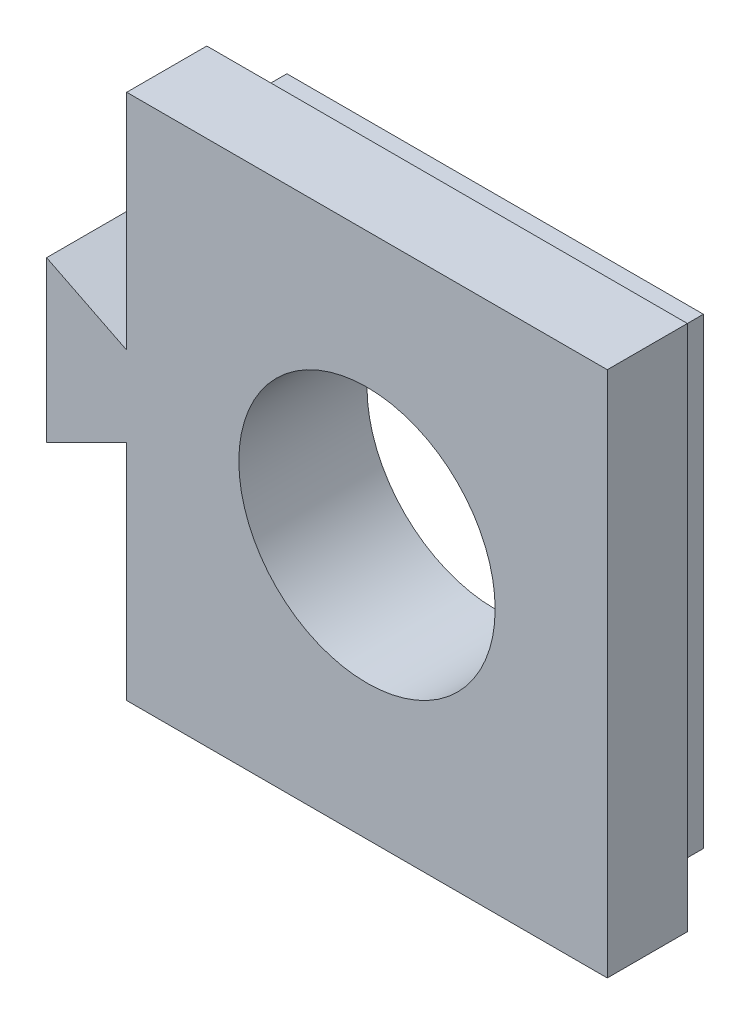
ISO-10303-21;
HEADER;
FILE_DESCRIPTION(('STEP AP214'),'2;1');
FILE_NAME('part.step','',(''),(''),'','','');
FILE_SCHEMA(('AUTOMOTIVE_DESIGN { 1 0 10303 214 1 1 1 1 }'));
ENDSEC;
DATA;
#1=APPLICATION_CONTEXT('core data for automotive mechanical design processes');
#2=APPLICATION_PROTOCOL_DEFINITION('international standard','automotive_design',2000,#1);
#3=PRODUCT_CONTEXT('',#1,'mechanical');
#4=PRODUCT('Part','Part','',(#3));
#5=PRODUCT_RELATED_PRODUCT_CATEGORY('part','',(#4));
#6=PRODUCT_DEFINITION_FORMATION('','',#4);
#7=PRODUCT_DEFINITION_CONTEXT('part definition',#1,'design');
#8=PRODUCT_DEFINITION('design','',#6,#7);
#9=PRODUCT_DEFINITION_SHAPE('','',#8);
#10=(LENGTH_UNIT() NAMED_UNIT(*) SI_UNIT(.MILLI.,.METRE.));
#11=(NAMED_UNIT(*) PLANE_ANGLE_UNIT() SI_UNIT($,.RADIAN.));
#12=(NAMED_UNIT(*) SI_UNIT($,.STERADIAN.) SOLID_ANGLE_UNIT());
#13=UNCERTAINTY_MEASURE_WITH_UNIT(LENGTH_MEASURE(1.E-05),#10,'distance_accuracy_value','');
#14=(GEOMETRIC_REPRESENTATION_CONTEXT(3) GLOBAL_UNCERTAINTY_ASSIGNED_CONTEXT((#13)) GLOBAL_UNIT_ASSIGNED_CONTEXT((#10,
#11,#12)) REPRESENTATION_CONTEXT('',''));
#15=CARTESIAN_POINT('',(0.,0.,0.));
#16=DIRECTION('',(0.,0.,1.));
#17=DIRECTION('',(1.,0.,0.));
#18=AXIS2_PLACEMENT_3D('',#15,#16,#17);
#19=CARTESIAN_POINT('',(-4.,25.6,8.));
#20=DIRECTION('',(1.,0.,0.));
#21=DIRECTION('',(0.,0.,-1.));
#22=AXIS2_PLACEMENT_3D('',#19,#20,#21);
#23=PLANE('',#22);
#24=DIRECTION('',(0.,0.,1.));
#25=VECTOR('',#24,1.);
#26=CARTESIAN_POINT('',(-4.,6.65760929328095,3.));
#27=LINE('',#26,#25);
#28=CARTESIAN_POINT('',(-4.,6.65760929328095,3.));
#29=VERTEX_POINT('',#28);
#30=CARTESIAN_POINT('',(-4.,6.65760929328095,8.));
#31=VERTEX_POINT('',#30);
#32=EDGE_CURVE('E173',#29,#31,#27,.T.);
#33=ORIENTED_EDGE('',*,*,#32,.F.);
#34=DIRECTION('',(0.,-1.,0.));
#35=VECTOR('',#34,1.);
#36=CARTESIAN_POINT('',(-4.,25.6,3.));
#37=LINE('',#36,#35);
#38=CARTESIAN_POINT('',(-4.,-7.28478141343808,3.));
#39=VERTEX_POINT('',#38);
#40=EDGE_CURVE('E193',#29,#39,#37,.T.);
#41=ORIENTED_EDGE('',*,*,#40,.T.);
#42=DIRECTION('',(0.,0.,-1.));
#43=VECTOR('',#42,1.);
#44=CARTESIAN_POINT('',(-4.,-7.28478141343808,8.));
#45=LINE('',#44,#43);
#46=CARTESIAN_POINT('',(-4.,-7.28478141343808,8.));
#47=VERTEX_POINT('',#46);
#48=EDGE_CURVE('E199',#47,#39,#45,.T.);
#49=ORIENTED_EDGE('',*,*,#48,.F.);
#50=DIRECTION('',(0.,-1.,0.));
#51=VECTOR('',#50,1.);
#52=CARTESIAN_POINT('',(-4.,25.6,8.));
#53=LINE('',#52,#51);
#54=EDGE_CURVE('E182',#31,#47,#53,.T.);
#55=ORIENTED_EDGE('',*,*,#54,.F.);
#56=EDGE_LOOP('',(#33,#41,#49,#55));
#57=FACE_BOUND('',#56,.T.);
#58=ADVANCED_FACE('F41',(#57),#23,.F.);
#59=CARTESIAN_POINT('',(0.,0.,0.));
#60=DIRECTION('',(0.,0.,-1.));
#61=DIRECTION('',(-1.,0.,0.));
#62=AXIS2_PLACEMENT_3D('',#59,#60,#61);
#63=PLANE('',#62);
#64=DIRECTION('',(0.,-1.,0.));
#65=VECTOR('',#64,1.);
#66=CARTESIAN_POINT('',(-2.,-5.28478141343808,0.));
#67=LINE('',#66,#65);
#68=CARTESIAN_POINT('',(-2.,23.6,0.));
#69=VERTEX_POINT('',#68);
#70=CARTESIAN_POINT('',(-2.,-5.28478141343808,0.));
#71=VERTEX_POINT('',#70);
#72=EDGE_CURVE('E211',#69,#71,#67,.T.);
#73=ORIENTED_EDGE('',*,*,#72,.F.);
#74=DIRECTION('',(-1.,0.,0.));
#75=VECTOR('',#74,1.);
#76=CARTESIAN_POINT('',(-2.,23.6,0.));
#77=LINE('',#76,#75);
#78=CARTESIAN_POINT('',(24.,23.6,0.));
#79=VERTEX_POINT('',#78);
#80=EDGE_CURVE('E86',#79,#69,#77,.T.);
#81=ORIENTED_EDGE('',*,*,#80,.F.);
#82=DIRECTION('',(0.,1.,0.));
#83=VECTOR('',#82,1.);
#84=CARTESIAN_POINT('',(24.,-5.28478141343808,0.));
#85=LINE('',#84,#83);
#86=CARTESIAN_POINT('',(24.,-5.28478141343808,0.));
#87=VERTEX_POINT('',#86);
#88=EDGE_CURVE('E227',#87,#79,#85,.T.);
#89=ORIENTED_EDGE('',*,*,#88,.F.);
#90=DIRECTION('',(1.,0.,0.));
#91=VECTOR('',#90,1.);
#92=CARTESIAN_POINT('',(-2.,-5.28478141343808,0.));
#93=LINE('',#92,#91);
#94=EDGE_CURVE('E225',#71,#87,#93,.T.);
#95=ORIENTED_EDGE('',*,*,#94,.F.);
#96=EDGE_LOOP('',(#73,#81,#89,#95));
#97=FACE_BOUND('',#96,.T.);
#98=CARTESIAN_POINT('',(11.,9.15760929328096,0.));
#99=DIRECTION('',(0.,0.,1.));
#100=DIRECTION('',(1.,0.,0.));
#101=AXIS2_PLACEMENT_3D('',#98,#99,#100);
#102=CIRCLE('',#101,8.);
#103=CARTESIAN_POINT('',(19.,9.15760929328096,0.));
#104=VERTEX_POINT('',#103);
#105=EDGE_CURVE('E208',#104,#104,#102,.T.);
#106=ORIENTED_EDGE('',*,*,#105,.T.);
#107=EDGE_LOOP('',(#106));
#108=FACE_BOUND('',#107,.T.);
#109=ADVANCED_FACE('F237',(#97,#108),#63,.T.);
#110=CARTESIAN_POINT('',(-2.,-5.28478141343808,3.));
#111=DIRECTION('',(1.,0.,0.));
#112=DIRECTION('',(0.,1.,0.));
#113=AXIS2_PLACEMENT_3D('',#110,#111,#112);
#114=PLANE('',#113);
#115=ORIENTED_EDGE('',*,*,#72,.T.);
#116=DIRECTION('',(0.,0.,-1.));
#117=VECTOR('',#116,1.);
#118=CARTESIAN_POINT('',(-2.,-5.28478141343808,3.));
#119=LINE('',#118,#117);
#120=CARTESIAN_POINT('',(-2.,-5.28478141343808,3.));
#121=VERTEX_POINT('',#120);
#122=EDGE_CURVE('E11',#121,#71,#119,.T.);
#123=ORIENTED_EDGE('',*,*,#122,.F.);
#124=DIRECTION('',(0.,-1.,0.));
#125=VECTOR('',#124,1.);
#126=CARTESIAN_POINT('',(-2.,-5.28478141343808,3.));
#127=LINE('',#126,#125);
#128=CARTESIAN_POINT('',(-2.,23.6,3.));
#129=VERTEX_POINT('',#128);
#130=EDGE_CURVE('E212',#129,#121,#127,.T.);
#131=ORIENTED_EDGE('',*,*,#130,.F.);
#132=DIRECTION('',(0.,0.,-1.));
#133=VECTOR('',#132,1.);
#134=CARTESIAN_POINT('',(-2.,23.6,3.));
#135=LINE('',#134,#133);
#136=EDGE_CURVE('E222',#129,#69,#135,.T.);
#137=ORIENTED_EDGE('',*,*,#136,.T.);
#138=EDGE_LOOP('',(#115,#123,#131,#137));
#139=FACE_BOUND('',#138,.T.);
#140=ADVANCED_FACE('F43',(#139),#114,.F.);
#141=CARTESIAN_POINT('',(-2.,-5.28478141343808,3.));
#142=DIRECTION('',(0.,1.,0.));
#143=DIRECTION('',(-1.,0.,0.));
#144=AXIS2_PLACEMENT_3D('',#141,#142,#143);
#145=PLANE('',#144);
#146=ORIENTED_EDGE('',*,*,#94,.T.);
#147=DIRECTION('',(0.,0.,-1.));
#148=VECTOR('',#147,1.);
#149=CARTESIAN_POINT('',(24.,-5.28478141343808,3.));
#150=LINE('',#149,#148);
#151=CARTESIAN_POINT('',(24.,-5.28478141343808,3.));
#152=VERTEX_POINT('',#151);
#153=EDGE_CURVE('E50',#152,#87,#150,.T.);
#154=ORIENTED_EDGE('',*,*,#153,.F.);
#155=DIRECTION('',(1.,0.,0.));
#156=VECTOR('',#155,1.);
#157=CARTESIAN_POINT('',(-2.,-5.28478141343808,3.));
#158=LINE('',#157,#156);
#159=EDGE_CURVE('E91',#121,#152,#158,.T.);
#160=ORIENTED_EDGE('',*,*,#159,.F.);
#161=ORIENTED_EDGE('',*,*,#122,.T.);
#162=EDGE_LOOP('',(#146,#154,#160,#161));
#163=FACE_BOUND('',#162,.T.);
#164=ADVANCED_FACE('F376',(#163),#145,.F.);
#165=CARTESIAN_POINT('',(24.,-5.28478141343808,3.));
#166=DIRECTION('',(-1.,0.,0.));
#167=DIRECTION('',(0.,-1.,0.));
#168=AXIS2_PLACEMENT_3D('',#165,#166,#167);
#169=PLANE('',#168);
#170=ORIENTED_EDGE('',*,*,#88,.T.);
#171=DIRECTION('',(0.,0.,-1.));
#172=VECTOR('',#171,1.);
#173=CARTESIAN_POINT('',(24.,23.6,3.));
#174=LINE('',#173,#172);
#175=CARTESIAN_POINT('',(24.,23.6,3.));
#176=VERTEX_POINT('',#175);
#177=EDGE_CURVE('E66',#176,#79,#174,.T.);
#178=ORIENTED_EDGE('',*,*,#177,.F.);
#179=DIRECTION('',(0.,1.,0.));
#180=VECTOR('',#179,1.);
#181=CARTESIAN_POINT('',(24.,-5.28478141343808,3.));
#182=LINE('',#181,#180);
#183=EDGE_CURVE('E216',#152,#176,#182,.T.);
#184=ORIENTED_EDGE('',*,*,#183,.F.);
#185=ORIENTED_EDGE('',*,*,#153,.T.);
#186=EDGE_LOOP('',(#170,#178,#184,#185));
#187=FACE_BOUND('',#186,.T.);
#188=ADVANCED_FACE('F234',(#187),#169,.F.);
#189=CARTESIAN_POINT('',(-2.,23.6,3.));
#190=DIRECTION('',(0.,-1.,0.));
#191=DIRECTION('',(1.,0.,0.));
#192=AXIS2_PLACEMENT_3D('',#189,#190,#191);
#193=PLANE('',#192);
#194=ORIENTED_EDGE('',*,*,#80,.T.);
#195=ORIENTED_EDGE('',*,*,#136,.F.);
#196=DIRECTION('',(-1.,0.,0.));
#197=VECTOR('',#196,1.);
#198=CARTESIAN_POINT('',(-2.,23.6,3.));
#199=LINE('',#198,#197);
#200=EDGE_CURVE('E219',#176,#129,#199,.T.);
#201=ORIENTED_EDGE('',*,*,#200,.F.);
#202=ORIENTED_EDGE('',*,*,#177,.T.);
#203=EDGE_LOOP('',(#194,#195,#201,#202));
#204=FACE_BOUND('',#203,.T.);
#205=ADVANCED_FACE('F240',(#204),#193,.F.);
#206=CARTESIAN_POINT('',(11.,9.15760929328096,3.));
#207=DIRECTION('',(0.,0.,-1.));
#208=DIRECTION('',(-1.,0.,0.));
#209=AXIS2_PLACEMENT_3D('',#206,#207,#208);
#210=CYLINDRICAL_SURFACE('',#209,8.);
#211=ORIENTED_EDGE('',*,*,#105,.F.);
#212=EDGE_LOOP('',(#211));
#213=FACE_BOUND('',#212,.T.);
#214=CARTESIAN_POINT('',(11.,9.15760929328096,8.));
#215=DIRECTION('',(0.,0.,1.));
#216=DIRECTION('',(1.,0.,0.));
#217=AXIS2_PLACEMENT_3D('',#214,#215,#216);
#218=CIRCLE('',#217,8.);
#219=CARTESIAN_POINT('',(19.,9.15760929328096,8.));
#220=VERTEX_POINT('',#219);
#221=EDGE_CURVE('E45',#220,#220,#218,.T.);
#222=ORIENTED_EDGE('',*,*,#221,.T.);
#223=EDGE_LOOP('',(#222));
#224=FACE_BOUND('',#223,.T.);
#225=ADVANCED_FACE('F301',(#213,#224),#210,.F.);
#226=CARTESIAN_POINT('',(26.,-7.28478141343808,8.));
#227=DIRECTION('',(-1.,0.,0.));
#228=DIRECTION('',(0.,-1.,0.));
#229=AXIS2_PLACEMENT_3D('',#226,#227,#228);
#230=PLANE('',#229);
#231=DIRECTION('',(0.,1.,0.));
#232=VECTOR('',#231,1.);
#233=CARTESIAN_POINT('',(26.,-7.28478141343808,3.));
#234=LINE('',#233,#232);
#235=CARTESIAN_POINT('',(26.,-7.28478141343808,3.));
#236=VERTEX_POINT('',#235);
#237=CARTESIAN_POINT('',(26.,25.6,3.));
#238=VERTEX_POINT('',#237);
#239=EDGE_CURVE('E172',#236,#238,#234,.T.);
#240=ORIENTED_EDGE('',*,*,#239,.T.);
#241=DIRECTION('',(0.,0.,-1.));
#242=VECTOR('',#241,1.);
#243=CARTESIAN_POINT('',(26.,25.6,8.));
#244=LINE('',#243,#242);
#245=CARTESIAN_POINT('',(26.,25.6,8.));
#246=VERTEX_POINT('',#245);
#247=EDGE_CURVE('E205',#246,#238,#244,.T.);
#248=ORIENTED_EDGE('',*,*,#247,.F.);
#249=DIRECTION('',(0.,1.,0.));
#250=VECTOR('',#249,1.);
#251=CARTESIAN_POINT('',(26.,-7.28478141343808,8.));
#252=LINE('',#251,#250);
#253=CARTESIAN_POINT('',(26.,-7.28478141343808,8.));
#254=VERTEX_POINT('',#253);
#255=EDGE_CURVE('E176',#254,#246,#252,.T.);
#256=ORIENTED_EDGE('',*,*,#255,.F.);
#257=DIRECTION('',(0.,0.,-1.));
#258=VECTOR('',#257,1.);
#259=CARTESIAN_POINT('',(26.,-7.28478141343808,8.));
#260=LINE('',#259,#258);
#261=EDGE_CURVE('E188',#254,#236,#260,.T.);
#262=ORIENTED_EDGE('',*,*,#261,.T.);
#263=EDGE_LOOP('',(#240,#248,#256,#262));
#264=FACE_BOUND('',#263,.T.);
#265=ADVANCED_FACE('F273',(#264),#230,.F.);
#266=CARTESIAN_POINT('',(26.,25.6,8.));
#267=DIRECTION('',(0.,-1.,0.));
#268=DIRECTION('',(1.,0.,0.));
#269=AXIS2_PLACEMENT_3D('',#266,#267,#268);
#270=PLANE('',#269);
#271=DIRECTION('',(-1.,0.,0.));
#272=VECTOR('',#271,1.);
#273=CARTESIAN_POINT('',(26.,25.6,3.));
#274=LINE('',#273,#272);
#275=CARTESIAN_POINT('',(-4.,25.6,3.));
#276=VERTEX_POINT('',#275);
#277=EDGE_CURVE('E191',#238,#276,#274,.T.);
#278=ORIENTED_EDGE('',*,*,#277,.T.);
#279=DIRECTION('',(0.,0.,-1.));
#280=VECTOR('',#279,1.);
#281=CARTESIAN_POINT('',(-4.,25.6,8.));
#282=LINE('',#281,#280);
#283=CARTESIAN_POINT('',(-4.,25.6,8.));
#284=VERTEX_POINT('',#283);
#285=EDGE_CURVE('E202',#284,#276,#282,.T.);
#286=ORIENTED_EDGE('',*,*,#285,.F.);
#287=DIRECTION('',(-1.,0.,0.));
#288=VECTOR('',#287,1.);
#289=CARTESIAN_POINT('',(26.,25.6,8.));
#290=LINE('',#289,#288);
#291=EDGE_CURVE('E179',#246,#284,#290,.T.);
#292=ORIENTED_EDGE('',*,*,#291,.F.);
#293=ORIENTED_EDGE('',*,*,#247,.T.);
#294=EDGE_LOOP('',(#278,#286,#292,#293));
#295=FACE_BOUND('',#294,.T.);
#296=ADVANCED_FACE('F267',(#295),#270,.F.);
#297=CARTESIAN_POINT('',(-4.,11.657609293281,3.));
#298=VERTEX_POINT('',#297);
#299=EDGE_CURVE('E194',#276,#298,#37,.T.);
#300=ORIENTED_EDGE('',*,*,#299,.T.);
#301=DIRECTION('',(0.,0.,1.));
#302=VECTOR('',#301,1.);
#303=CARTESIAN_POINT('',(-4.,11.657609293281,3.));
#304=LINE('',#303,#302);
#305=CARTESIAN_POINT('',(-4.,11.657609293281,8.));
#306=VERTEX_POINT('',#305);
#307=EDGE_CURVE('E162',#298,#306,#304,.T.);
#308=ORIENTED_EDGE('',*,*,#307,.T.);
#309=EDGE_CURVE('E183',#284,#306,#53,.T.);
#310=ORIENTED_EDGE('',*,*,#309,.F.);
#311=ORIENTED_EDGE('',*,*,#285,.T.);
#312=EDGE_LOOP('',(#300,#308,#310,#311));
#313=FACE_BOUND('',#312,.T.);
#314=ADVANCED_FACE('F259',(#313),#23,.F.);
#315=CARTESIAN_POINT('',(-4.,-7.28478141343808,8.));
#316=DIRECTION('',(0.,1.,0.));
#317=DIRECTION('',(-1.,0.,0.));
#318=AXIS2_PLACEMENT_3D('',#315,#316,#317);
#319=PLANE('',#318);
#320=DIRECTION('',(1.,0.,0.));
#321=VECTOR('',#320,1.);
#322=CARTESIAN_POINT('',(-4.,-7.28478141343808,3.));
#323=LINE('',#322,#321);
#324=EDGE_CURVE('E180',#39,#236,#323,.T.);
#325=ORIENTED_EDGE('',*,*,#324,.T.);
#326=ORIENTED_EDGE('',*,*,#261,.F.);
#327=DIRECTION('',(1.,0.,0.));
#328=VECTOR('',#327,1.);
#329=CARTESIAN_POINT('',(-4.,-7.28478141343808,8.));
#330=LINE('',#329,#328);
#331=EDGE_CURVE('E186',#47,#254,#330,.T.);
#332=ORIENTED_EDGE('',*,*,#331,.F.);
#333=ORIENTED_EDGE('',*,*,#48,.T.);
#334=EDGE_LOOP('',(#325,#326,#332,#333));
#335=FACE_BOUND('',#334,.T.);
#336=ADVANCED_FACE('F252',(#335),#319,.F.);
#337=CARTESIAN_POINT('',(0.,0.,8.));
#338=DIRECTION('',(0.,0.,1.));
#339=DIRECTION('',(1.,0.,0.));
#340=AXIS2_PLACEMENT_3D('',#337,#338,#339);
#341=PLANE('',#340);
#342=ORIENTED_EDGE('',*,*,#221,.F.);
#343=EDGE_LOOP('',(#342));
#344=FACE_BOUND('',#343,.T.);
#345=ORIENTED_EDGE('',*,*,#255,.T.);
#346=ORIENTED_EDGE('',*,*,#291,.T.);
#347=ORIENTED_EDGE('',*,*,#309,.T.);
#348=DIRECTION('',(-0.894427190999916,0.447213595499958,0.));
#349=VECTOR('',#348,1.);
#350=CARTESIAN_POINT('',(-9.,14.157609293281,8.));
#351=LINE('',#350,#349);
#352=CARTESIAN_POINT('',(-9.,14.157609293281,8.));
#353=VERTEX_POINT('',#352);
#354=EDGE_CURVE('E57',#306,#353,#351,.T.);
#355=ORIENTED_EDGE('',*,*,#354,.T.);
#356=DIRECTION('',(0.,-1.,0.));
#357=VECTOR('',#356,1.);
#358=CARTESIAN_POINT('',(-9.,14.157609293281,8.));
#359=LINE('',#358,#357);
#360=CARTESIAN_POINT('',(-9.,4.15760929328096,8.));
#361=VERTEX_POINT('',#360);
#362=EDGE_CURVE('E146',#353,#361,#359,.T.);
#363=ORIENTED_EDGE('',*,*,#362,.T.);
#364=DIRECTION('',(0.894427190999916,0.447213595499958,0.));
#365=VECTOR('',#364,1.);
#366=CARTESIAN_POINT('',(-9.,4.15760929328096,8.));
#367=LINE('',#366,#365);
#368=EDGE_CURVE('E163',#361,#31,#367,.T.);
#369=ORIENTED_EDGE('',*,*,#368,.T.);
#370=ORIENTED_EDGE('',*,*,#54,.T.);
#371=ORIENTED_EDGE('',*,*,#331,.T.);
#372=EDGE_LOOP('',(#345,#346,#347,#355,#363,#369,#370,#371));
#373=FACE_BOUND('',#372,.T.);
#374=ADVANCED_FACE('F243',(#344,#373),#341,.T.);
#375=CARTESIAN_POINT('',(0.,0.,3.));
#376=DIRECTION('',(0.,0.,1.));
#377=DIRECTION('',(1.,0.,0.));
#378=AXIS2_PLACEMENT_3D('',#375,#376,#377);
#379=PLANE('',#378);
#380=ORIENTED_EDGE('',*,*,#200,.T.);
#381=ORIENTED_EDGE('',*,*,#130,.T.);
#382=ORIENTED_EDGE('',*,*,#159,.T.);
#383=ORIENTED_EDGE('',*,*,#183,.T.);
#384=EDGE_LOOP('',(#380,#381,#382,#383));
#385=FACE_BOUND('',#384,.T.);
#386=ORIENTED_EDGE('',*,*,#239,.F.);
#387=ORIENTED_EDGE('',*,*,#324,.F.);
#388=ORIENTED_EDGE('',*,*,#40,.F.);
#389=DIRECTION('',(0.894427190999916,0.447213595499958,0.));
#390=VECTOR('',#389,1.);
#391=CARTESIAN_POINT('',(-9.,4.15760929328096,3.));
#392=LINE('',#391,#390);
#393=CARTESIAN_POINT('',(-9.,4.15760929328096,3.));
#394=VERTEX_POINT('',#393);
#395=EDGE_CURVE('E149',#394,#29,#392,.T.);
#396=ORIENTED_EDGE('',*,*,#395,.F.);
#397=DIRECTION('',(0.,-1.,0.));
#398=VECTOR('',#397,1.);
#399=CARTESIAN_POINT('',(-9.,14.157609293281,3.));
#400=LINE('',#399,#398);
#401=CARTESIAN_POINT('',(-9.,14.157609293281,3.));
#402=VERTEX_POINT('',#401);
#403=EDGE_CURVE('E144',#402,#394,#400,.T.);
#404=ORIENTED_EDGE('',*,*,#403,.F.);
#405=DIRECTION('',(-0.894427190999916,0.447213595499958,0.));
#406=VECTOR('',#405,1.);
#407=CARTESIAN_POINT('',(-9.,14.157609293281,3.));
#408=LINE('',#407,#406);
#409=EDGE_CURVE('E157',#298,#402,#408,.T.);
#410=ORIENTED_EDGE('',*,*,#409,.F.);
#411=ORIENTED_EDGE('',*,*,#299,.F.);
#412=ORIENTED_EDGE('',*,*,#277,.F.);
#413=EDGE_LOOP('',(#386,#387,#388,#396,#404,#410,#411,#412));
#414=FACE_BOUND('',#413,.T.);
#415=ADVANCED_FACE('F155',(#385,#414),#379,.F.);
#416=CARTESIAN_POINT('',(-9.,14.157609293281,3.));
#417=DIRECTION('',(0.447213595499958,0.894427190999916,0.));
#418=DIRECTION('',(-0.894427190999916,0.447213595499958,0.));
#419=AXIS2_PLACEMENT_3D('',#416,#417,#418);
#420=PLANE('',#419);
#421=ORIENTED_EDGE('',*,*,#354,.F.);
#422=ORIENTED_EDGE('',*,*,#307,.F.);
#423=ORIENTED_EDGE('',*,*,#409,.T.);
#424=DIRECTION('',(0.,0.,1.));
#425=VECTOR('',#424,1.);
#426=CARTESIAN_POINT('',(-9.,14.157609293281,3.));
#427=LINE('',#426,#425);
#428=EDGE_CURVE('E141',#402,#353,#427,.T.);
#429=ORIENTED_EDGE('',*,*,#428,.T.);
#430=EDGE_LOOP('',(#421,#422,#423,#429));
#431=FACE_BOUND('',#430,.T.);
#432=ADVANCED_FACE('F161',(#431),#420,.T.);
#433=CARTESIAN_POINT('',(-9.,4.15760929328096,3.));
#434=DIRECTION('',(0.447213595499958,-0.894427190999916,0.));
#435=DIRECTION('',(0.894427190999916,0.447213595499958,0.));
#436=AXIS2_PLACEMENT_3D('',#433,#434,#435);
#437=PLANE('',#436);
#438=ORIENTED_EDGE('',*,*,#368,.F.);
#439=DIRECTION('',(0.,0.,1.));
#440=VECTOR('',#439,1.);
#441=CARTESIAN_POINT('',(-9.,4.15760929328096,3.));
#442=LINE('',#441,#440);
#443=EDGE_CURVE('E148',#394,#361,#442,.T.);
#444=ORIENTED_EDGE('',*,*,#443,.F.);
#445=ORIENTED_EDGE('',*,*,#395,.T.);
#446=ORIENTED_EDGE('',*,*,#32,.T.);
#447=EDGE_LOOP('',(#438,#444,#445,#446));
#448=FACE_BOUND('',#447,.T.);
#449=ADVANCED_FACE('F249',(#448),#437,.T.);
#450=CARTESIAN_POINT('',(-9.,14.157609293281,3.));
#451=DIRECTION('',(-1.,0.,0.));
#452=DIRECTION('',(0.,0.,1.));
#453=AXIS2_PLACEMENT_3D('',#450,#451,#452);
#454=PLANE('',#453);
#455=ORIENTED_EDGE('',*,*,#362,.F.);
#456=ORIENTED_EDGE('',*,*,#428,.F.);
#457=ORIENTED_EDGE('',*,*,#403,.T.);
#458=ORIENTED_EDGE('',*,*,#443,.T.);
#459=EDGE_LOOP('',(#455,#456,#457,#458));
#460=FACE_BOUND('',#459,.T.);
#461=ADVANCED_FACE('F143',(#460),#454,.T.);
#462=CLOSED_SHELL('',(#58,#109,#140,#164,#188,#205,#225,#265,#296,#314,#336,#374,#415,#432,#449,#461));
#463=MANIFOLD_SOLID_BREP('B2',#462);
#464=ADVANCED_BREP_SHAPE_REPRESENTATION('',(#18,#463),#14);
#465=SHAPE_DEFINITION_REPRESENTATION(#9,#464);
ENDSEC;
END-ISO-10303-21;
